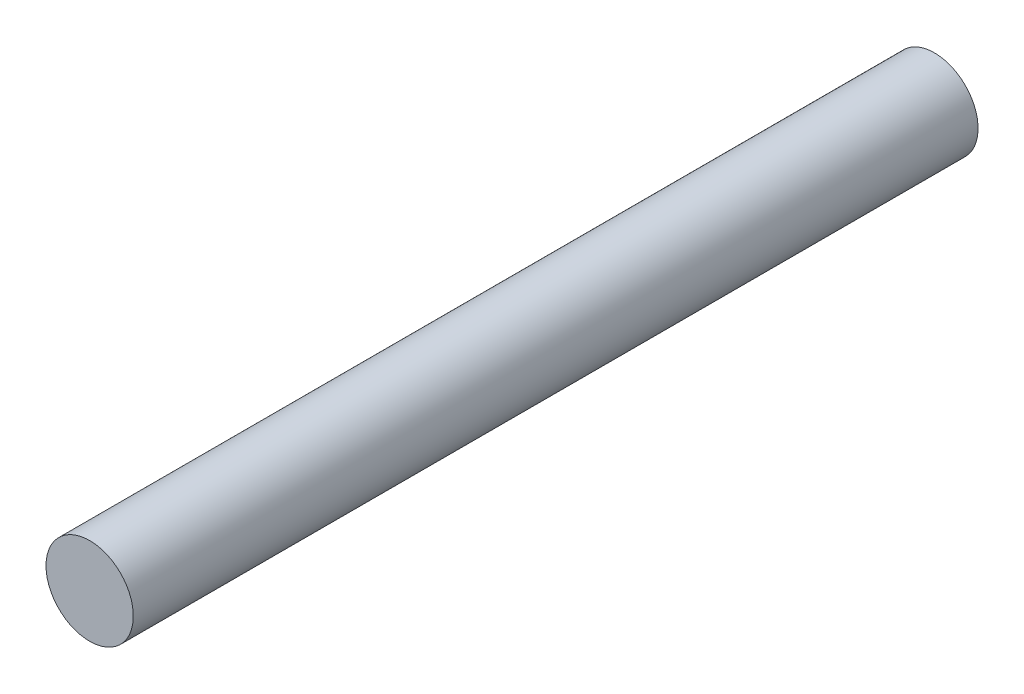
ISO-10303-21;
HEADER;
FILE_DESCRIPTION(('STEP AP214'),'2;1');
FILE_NAME('part.step','',(''),(''),'','','');
FILE_SCHEMA(('AUTOMOTIVE_DESIGN { 1 0 10303 214 1 1 1 1 }'));
ENDSEC;
DATA;
#1=APPLICATION_CONTEXT('core data for automotive mechanical design processes');
#2=APPLICATION_PROTOCOL_DEFINITION('international standard','automotive_design',2000,#1);
#3=PRODUCT_CONTEXT('',#1,'mechanical');
#4=PRODUCT('Part','Part','',(#3));
#5=PRODUCT_RELATED_PRODUCT_CATEGORY('part','',(#4));
#6=PRODUCT_DEFINITION_FORMATION('','',#4);
#7=PRODUCT_DEFINITION_CONTEXT('part definition',#1,'design');
#8=PRODUCT_DEFINITION('design','',#6,#7);
#9=PRODUCT_DEFINITION_SHAPE('','',#8);
#10=(LENGTH_UNIT() NAMED_UNIT(*) SI_UNIT(.MILLI.,.METRE.));
#11=(NAMED_UNIT(*) PLANE_ANGLE_UNIT() SI_UNIT($,.RADIAN.));
#12=(NAMED_UNIT(*) SI_UNIT($,.STERADIAN.) SOLID_ANGLE_UNIT());
#13=UNCERTAINTY_MEASURE_WITH_UNIT(LENGTH_MEASURE(1.E-05),#10,'distance_accuracy_value','');
#14=(GEOMETRIC_REPRESENTATION_CONTEXT(3) GLOBAL_UNCERTAINTY_ASSIGNED_CONTEXT((#13)) GLOBAL_UNIT_ASSIGNED_CONTEXT((#10,
#11,#12)) REPRESENTATION_CONTEXT('',''));
#15=CARTESIAN_POINT('',(0.,0.,0.));
#16=DIRECTION('',(0.,0.,1.));
#17=DIRECTION('',(1.,0.,0.));
#18=AXIS2_PLACEMENT_3D('',#15,#16,#17);
#19=CARTESIAN_POINT('',(0.,0.,0.));
#20=DIRECTION('',(0.,0.,1.));
#21=DIRECTION('',(1.,0.,0.));
#22=AXIS2_PLACEMENT_3D('',#19,#20,#21);
#23=PLANE('',#22);
#24=CARTESIAN_POINT('',(0.,0.,0.));
#25=DIRECTION('',(0.,0.,-1.));
#26=DIRECTION('',(-1.,0.,0.));
#27=AXIS2_PLACEMENT_3D('',#24,#25,#26);
#28=CIRCLE('',#27,0.52500022);
#29=CARTESIAN_POINT('',(-0.52500022,0.,0.));
#30=VERTEX_POINT('',#29);
#31=EDGE_CURVE('E18',#30,#30,#28,.F.);
#32=ORIENTED_EDGE('',*,*,#31,.F.);
#33=EDGE_LOOP('',(#32));
#34=FACE_BOUND('',#33,.T.);
#35=ADVANCED_FACE('F15',(#34),#23,.F.);
#36=CARTESIAN_POINT('',(0.,0.,10.16));
#37=DIRECTION('',(0.,0.,1.));
#38=DIRECTION('',(1.,0.,0.));
#39=AXIS2_PLACEMENT_3D('',#36,#37,#38);
#40=PLANE('',#39);
#41=CARTESIAN_POINT('',(0.,0.,10.16));
#42=DIRECTION('',(0.,0.,-1.));
#43=DIRECTION('',(-1.,0.,0.));
#44=AXIS2_PLACEMENT_3D('',#41,#42,#43);
#45=CIRCLE('',#44,0.52500022);
#46=CARTESIAN_POINT('',(-0.52500022,0.,10.16));
#47=VERTEX_POINT('',#46);
#48=EDGE_CURVE('E10',#47,#47,#45,.T.);
#49=ORIENTED_EDGE('',*,*,#48,.F.);
#50=EDGE_LOOP('',(#49));
#51=FACE_BOUND('',#50,.T.);
#52=ADVANCED_FACE('F30',(#51),#40,.T.);
#53=CARTESIAN_POINT('',(0.,0.,0.));
#54=DIRECTION('',(0.,0.,-1.));
#55=DIRECTION('',(-1.,0.,0.));
#56=AXIS2_PLACEMENT_3D('',#53,#54,#55);
#57=CYLINDRICAL_SURFACE('',#56,0.52500022);
#58=ORIENTED_EDGE('',*,*,#48,.T.);
#59=EDGE_LOOP('',(#58));
#60=FACE_BOUND('',#59,.T.);
#61=ORIENTED_EDGE('',*,*,#31,.T.);
#62=EDGE_LOOP('',(#61));
#63=FACE_BOUND('',#62,.T.);
#64=ADVANCED_FACE('F27',(#60,#63),#57,.T.);
#65=CLOSED_SHELL('',(#35,#52,#64));
#66=MANIFOLD_SOLID_BREP('B1',#65);
#67=ADVANCED_BREP_SHAPE_REPRESENTATION('',(#18,#66),#14);
#68=SHAPE_DEFINITION_REPRESENTATION(#9,#67);
ENDSEC;
END-ISO-10303-21;
